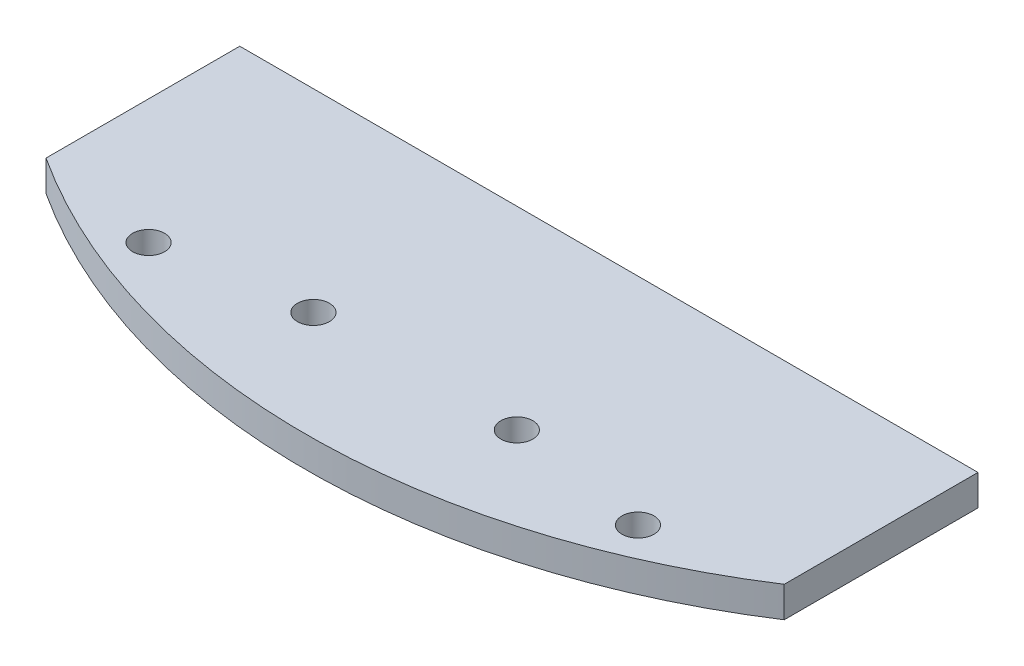
ISO-10303-21;
HEADER;
FILE_DESCRIPTION(('STEP AP214'),'2;1');
FILE_NAME('part.step','',(''),(''),'','','');
FILE_SCHEMA(('AUTOMOTIVE_DESIGN { 1 0 10303 214 1 1 1 1 }'));
ENDSEC;
DATA;
#1=APPLICATION_CONTEXT('core data for automotive mechanical design processes');
#2=APPLICATION_PROTOCOL_DEFINITION('international standard','automotive_design',2000,#1);
#3=PRODUCT_CONTEXT('',#1,'mechanical');
#4=PRODUCT('Part','Part','',(#3));
#5=PRODUCT_RELATED_PRODUCT_CATEGORY('part','',(#4));
#6=PRODUCT_DEFINITION_FORMATION('','',#4);
#7=PRODUCT_DEFINITION_CONTEXT('part definition',#1,'design');
#8=PRODUCT_DEFINITION('design','',#6,#7);
#9=PRODUCT_DEFINITION_SHAPE('','',#8);
#10=(LENGTH_UNIT() NAMED_UNIT(*) SI_UNIT(.MILLI.,.METRE.));
#11=(NAMED_UNIT(*) PLANE_ANGLE_UNIT() SI_UNIT($,.RADIAN.));
#12=(NAMED_UNIT(*) SI_UNIT($,.STERADIAN.) SOLID_ANGLE_UNIT());
#13=UNCERTAINTY_MEASURE_WITH_UNIT(LENGTH_MEASURE(1.E-05),#10,'distance_accuracy_value','');
#14=(GEOMETRIC_REPRESENTATION_CONTEXT(3) GLOBAL_UNCERTAINTY_ASSIGNED_CONTEXT((#13)) GLOBAL_UNIT_ASSIGNED_CONTEXT((#10,
#11,#12)) REPRESENTATION_CONTEXT('',''));
#15=CARTESIAN_POINT('',(0.,0.,0.));
#16=DIRECTION('',(0.,0.,1.));
#17=DIRECTION('',(1.,0.,0.));
#18=AXIS2_PLACEMENT_3D('',#15,#16,#17);
#19=CARTESIAN_POINT('',(0.,3.175,0.));
#20=DIRECTION('',(0.,-1.,0.));
#21=DIRECTION('',(0.,0.,-1.));
#22=AXIS2_PLACEMENT_3D('',#19,#20,#21);
#23=CYLINDRICAL_SURFACE('',#22,70.);
#24=CARTESIAN_POINT('',(0.,0.,0.));
#25=DIRECTION('',(0.,1.,0.));
#26=DIRECTION('',(0.,0.,1.));
#27=AXIS2_PLACEMENT_3D('',#24,#25,#26);
#28=CIRCLE('',#27,70.);
#29=CARTESIAN_POINT('',(38.1,0.,58.7229937928917));
#30=VERTEX_POINT('',#29);
#31=CARTESIAN_POINT('',(-38.1,0.,58.7229937928917));
#32=VERTEX_POINT('',#31);
#33=EDGE_CURVE('E111',#30,#32,#28,.F.);
#34=ORIENTED_EDGE('',*,*,#33,.F.);
#35=DIRECTION('',(0.,-1.,0.));
#36=VECTOR('',#35,1.);
#37=CARTESIAN_POINT('',(38.1,3.175,58.7229937928917));
#38=LINE('',#37,#36);
#39=CARTESIAN_POINT('',(38.1,3.175,58.7229937928917));
#40=VERTEX_POINT('',#39);
#41=EDGE_CURVE('E11',#40,#30,#38,.T.);
#42=ORIENTED_EDGE('',*,*,#41,.F.);
#43=CARTESIAN_POINT('',(0.,3.175,0.));
#44=DIRECTION('',(0.,1.,0.));
#45=DIRECTION('',(0.,0.,1.));
#46=AXIS2_PLACEMENT_3D('',#43,#44,#45);
#47=CIRCLE('',#46,70.);
#48=CARTESIAN_POINT('',(-38.1,3.175,58.7229937928917));
#49=VERTEX_POINT('',#48);
#50=EDGE_CURVE('E92',#40,#49,#47,.F.);
#51=ORIENTED_EDGE('',*,*,#50,.T.);
#52=DIRECTION('',(0.,-1.,0.));
#53=VECTOR('',#52,1.);
#54=CARTESIAN_POINT('',(-38.1,3.175,58.7229937928917));
#55=LINE('',#54,#53);
#56=EDGE_CURVE('E74',#49,#32,#55,.T.);
#57=ORIENTED_EDGE('',*,*,#56,.T.);
#58=EDGE_LOOP('',(#34,#42,#51,#57));
#59=FACE_BOUND('',#58,.T.);
#60=ADVANCED_FACE('F35',(#59),#23,.T.);
#61=CARTESIAN_POINT('',(38.1,3.175,0.));
#62=DIRECTION('',(1.,0.,0.));
#63=DIRECTION('',(0.,0.,-1.));
#64=AXIS2_PLACEMENT_3D('',#61,#62,#63);
#65=PLANE('',#64);
#66=DIRECTION('',(0.,0.,1.));
#67=VECTOR('',#66,1.);
#68=CARTESIAN_POINT('',(38.1,0.,0.));
#69=LINE('',#68,#67);
#70=CARTESIAN_POINT('',(38.1,0.,38.7229937928917));
#71=VERTEX_POINT('',#70);
#72=EDGE_CURVE('E85',#71,#30,#69,.T.);
#73=ORIENTED_EDGE('',*,*,#72,.F.);
#74=DIRECTION('',(0.,-1.,0.));
#75=VECTOR('',#74,1.);
#76=CARTESIAN_POINT('',(38.1,3.175,38.7229937928917));
#77=LINE('',#76,#75);
#78=CARTESIAN_POINT('',(38.1,3.175,38.7229937928917));
#79=VERTEX_POINT('',#78);
#80=EDGE_CURVE('E44',#79,#71,#77,.T.);
#81=ORIENTED_EDGE('',*,*,#80,.F.);
#82=DIRECTION('',(0.,0.,1.));
#83=VECTOR('',#82,1.);
#84=CARTESIAN_POINT('',(38.1,3.175,0.));
#85=LINE('',#84,#83);
#86=EDGE_CURVE('E83',#79,#40,#85,.T.);
#87=ORIENTED_EDGE('',*,*,#86,.T.);
#88=ORIENTED_EDGE('',*,*,#41,.T.);
#89=EDGE_LOOP('',(#73,#81,#87,#88));
#90=FACE_BOUND('',#89,.T.);
#91=ADVANCED_FACE('F82',(#90),#65,.T.);
#92=CARTESIAN_POINT('',(0.,3.175,38.7229937928917));
#93=DIRECTION('',(0.,0.,-1.));
#94=DIRECTION('',(-1.,0.,0.));
#95=AXIS2_PLACEMENT_3D('',#92,#93,#94);
#96=PLANE('',#95);
#97=DIRECTION('',(1.,0.,0.));
#98=VECTOR('',#97,1.);
#99=CARTESIAN_POINT('',(0.,0.,38.7229937928917));
#100=LINE('',#99,#98);
#101=CARTESIAN_POINT('',(-38.1,0.,38.7229937928917));
#102=VERTEX_POINT('',#101);
#103=EDGE_CURVE('E115',#102,#71,#100,.T.);
#104=ORIENTED_EDGE('',*,*,#103,.F.);
#105=DIRECTION('',(0.,-1.,0.));
#106=VECTOR('',#105,1.);
#107=CARTESIAN_POINT('',(-38.1,3.175,38.7229937928917));
#108=LINE('',#107,#106);
#109=CARTESIAN_POINT('',(-38.1,3.175,38.7229937928917));
#110=VERTEX_POINT('',#109);
#111=EDGE_CURVE('E67',#110,#102,#108,.T.);
#112=ORIENTED_EDGE('',*,*,#111,.F.);
#113=DIRECTION('',(1.,0.,0.));
#114=VECTOR('',#113,1.);
#115=CARTESIAN_POINT('',(0.,3.175,38.7229937928917));
#116=LINE('',#115,#114);
#117=EDGE_CURVE('E91',#110,#79,#116,.T.);
#118=ORIENTED_EDGE('',*,*,#117,.T.);
#119=ORIENTED_EDGE('',*,*,#80,.T.);
#120=EDGE_LOOP('',(#104,#112,#118,#119));
#121=FACE_BOUND('',#120,.T.);
#122=ADVANCED_FACE('F94',(#121),#96,.T.);
#123=CARTESIAN_POINT('',(-25.2571065360959,3.175,60.976049145745));
#124=DIRECTION('',(0.,-1.,0.));
#125=DIRECTION('',(0.,0.,-1.));
#126=AXIS2_PLACEMENT_3D('',#123,#124,#125);
#127=CYLINDRICAL_SURFACE('',#126,1.65);
#128=CARTESIAN_POINT('',(-25.2571065360959,3.175,60.976049145745));
#129=DIRECTION('',(0.,1.,0.));
#130=DIRECTION('',(0.,0.,1.));
#131=AXIS2_PLACEMENT_3D('',#128,#129,#130);
#132=CIRCLE('',#131,1.65);
#133=CARTESIAN_POINT('',(-25.2571065360959,3.175,62.626049145745));
#134=VERTEX_POINT('',#133);
#135=EDGE_CURVE('E132',#134,#134,#132,.T.);
#136=ORIENTED_EDGE('',*,*,#135,.T.);
#137=EDGE_LOOP('',(#136));
#138=FACE_BOUND('',#137,.T.);
#139=CARTESIAN_POINT('',(-25.2571065360959,0.,60.976049145745));
#140=DIRECTION('',(0.,1.,0.));
#141=DIRECTION('',(0.,0.,1.));
#142=AXIS2_PLACEMENT_3D('',#139,#140,#141);
#143=CIRCLE('',#142,1.65);
#144=CARTESIAN_POINT('',(-25.2571065360959,0.,62.626049145745));
#145=VERTEX_POINT('',#144);
#146=EDGE_CURVE('E108',#145,#145,#143,.T.);
#147=ORIENTED_EDGE('',*,*,#146,.F.);
#148=EDGE_LOOP('',(#147));
#149=FACE_BOUND('',#148,.T.);
#150=ADVANCED_FACE('F142',(#138,#149),#127,.F.);
#151=CARTESIAN_POINT('',(25.2571065360959,3.175,60.976049145745));
#152=DIRECTION('',(0.,-1.,0.));
#153=DIRECTION('',(0.,0.,-1.));
#154=AXIS2_PLACEMENT_3D('',#151,#152,#153);
#155=CYLINDRICAL_SURFACE('',#154,1.65);
#156=CARTESIAN_POINT('',(25.2571065360959,3.175,60.976049145745));
#157=DIRECTION('',(0.,1.,0.));
#158=DIRECTION('',(0.,0.,1.));
#159=AXIS2_PLACEMENT_3D('',#156,#157,#158);
#160=CIRCLE('',#159,1.65);
#161=CARTESIAN_POINT('',(25.2571065360959,3.175,62.626049145745));
#162=VERTEX_POINT('',#161);
#163=EDGE_CURVE('E127',#162,#162,#160,.T.);
#164=ORIENTED_EDGE('',*,*,#163,.T.);
#165=EDGE_LOOP('',(#164));
#166=FACE_BOUND('',#165,.T.);
#167=CARTESIAN_POINT('',(25.2571065360959,0.,60.976049145745));
#168=DIRECTION('',(0.,1.,0.));
#169=DIRECTION('',(0.,0.,1.));
#170=AXIS2_PLACEMENT_3D('',#167,#168,#169);
#171=CIRCLE('',#170,1.65);
#172=CARTESIAN_POINT('',(25.2571065360959,0.,62.626049145745));
#173=VERTEX_POINT('',#172);
#174=EDGE_CURVE('E105',#173,#173,#171,.T.);
#175=ORIENTED_EDGE('',*,*,#174,.F.);
#176=EDGE_LOOP('',(#175));
#177=FACE_BOUND('',#176,.T.);
#178=ADVANCED_FACE('F145',(#166,#177),#155,.F.);
#179=CARTESIAN_POINT('',(10.5,3.175,58.7229937928917));
#180=DIRECTION('',(0.,-1.,0.));
#181=DIRECTION('',(0.,0.,-1.));
#182=AXIS2_PLACEMENT_3D('',#179,#180,#181);
#183=CYLINDRICAL_SURFACE('',#182,1.65);
#184=CARTESIAN_POINT('',(10.5,3.175,58.7229937928917));
#185=DIRECTION('',(0.,1.,0.));
#186=DIRECTION('',(0.,0.,1.));
#187=AXIS2_PLACEMENT_3D('',#184,#185,#186);
#188=CIRCLE('',#187,1.65);
#189=CARTESIAN_POINT('',(10.5,3.175,60.3729937928917));
#190=VERTEX_POINT('',#189);
#191=EDGE_CURVE('E122',#190,#190,#188,.T.);
#192=ORIENTED_EDGE('',*,*,#191,.T.);
#193=EDGE_LOOP('',(#192));
#194=FACE_BOUND('',#193,.T.);
#195=CARTESIAN_POINT('',(10.5,0.,58.7229937928917));
#196=DIRECTION('',(0.,1.,0.));
#197=DIRECTION('',(0.,0.,1.));
#198=AXIS2_PLACEMENT_3D('',#195,#196,#197);
#199=CIRCLE('',#198,1.65);
#200=CARTESIAN_POINT('',(10.5,0.,60.3729937928917));
#201=VERTEX_POINT('',#200);
#202=EDGE_CURVE('E102',#201,#201,#199,.T.);
#203=ORIENTED_EDGE('',*,*,#202,.F.);
#204=EDGE_LOOP('',(#203));
#205=FACE_BOUND('',#204,.T.);
#206=ADVANCED_FACE('F148',(#194,#205),#183,.F.);
#207=CARTESIAN_POINT('',(-10.5,3.175,58.7229937928918));
#208=DIRECTION('',(0.,-1.,0.));
#209=DIRECTION('',(0.,0.,-1.));
#210=AXIS2_PLACEMENT_3D('',#207,#208,#209);
#211=CYLINDRICAL_SURFACE('',#210,1.65);
#212=CARTESIAN_POINT('',(-10.5,3.175,58.7229937928918));
#213=DIRECTION('',(0.,1.,0.));
#214=DIRECTION('',(0.,0.,1.));
#215=AXIS2_PLACEMENT_3D('',#212,#213,#214);
#216=CIRCLE('',#215,1.65);
#217=CARTESIAN_POINT('',(-10.5,3.175,60.3729937928918));
#218=VERTEX_POINT('',#217);
#219=EDGE_CURVE('E119',#218,#218,#216,.T.);
#220=ORIENTED_EDGE('',*,*,#219,.T.);
#221=EDGE_LOOP('',(#220));
#222=FACE_BOUND('',#221,.T.);
#223=CARTESIAN_POINT('',(-10.5,0.,58.7229937928918));
#224=DIRECTION('',(0.,1.,0.));
#225=DIRECTION('',(0.,0.,1.));
#226=AXIS2_PLACEMENT_3D('',#223,#224,#225);
#227=CIRCLE('',#226,1.65);
#228=CARTESIAN_POINT('',(-10.5,0.,60.3729937928918));
#229=VERTEX_POINT('',#228);
#230=EDGE_CURVE('E99',#229,#229,#227,.T.);
#231=ORIENTED_EDGE('',*,*,#230,.F.);
#232=EDGE_LOOP('',(#231));
#233=FACE_BOUND('',#232,.T.);
#234=ADVANCED_FACE('F37',(#222,#233),#211,.F.);
#235=CARTESIAN_POINT('',(-38.1,3.175,0.));
#236=DIRECTION('',(1.,0.,0.));
#237=DIRECTION('',(0.,0.,-1.));
#238=AXIS2_PLACEMENT_3D('',#235,#236,#237);
#239=PLANE('',#238);
#240=DIRECTION('',(0.,0.,1.));
#241=VECTOR('',#240,1.);
#242=CARTESIAN_POINT('',(-38.1,0.,0.));
#243=LINE('',#242,#241);
#244=EDGE_CURVE('E117',#102,#32,#243,.T.);
#245=ORIENTED_EDGE('',*,*,#244,.T.);
#246=ORIENTED_EDGE('',*,*,#56,.F.);
#247=DIRECTION('',(0.,0.,1.));
#248=VECTOR('',#247,1.);
#249=CARTESIAN_POINT('',(-38.1,3.175,0.));
#250=LINE('',#249,#248);
#251=EDGE_CURVE('E52',#110,#49,#250,.T.);
#252=ORIENTED_EDGE('',*,*,#251,.F.);
#253=ORIENTED_EDGE('',*,*,#111,.T.);
#254=EDGE_LOOP('',(#245,#246,#252,#253));
#255=FACE_BOUND('',#254,.T.);
#256=ADVANCED_FACE('F155',(#255),#239,.F.);
#257=CARTESIAN_POINT('',(0.,3.175,0.));
#258=DIRECTION('',(0.,1.,0.));
#259=DIRECTION('',(0.,0.,1.));
#260=AXIS2_PLACEMENT_3D('',#257,#258,#259);
#261=PLANE('',#260);
#262=ORIENTED_EDGE('',*,*,#219,.F.);
#263=EDGE_LOOP('',(#262));
#264=FACE_BOUND('',#263,.T.);
#265=ORIENTED_EDGE('',*,*,#191,.F.);
#266=EDGE_LOOP('',(#265));
#267=FACE_BOUND('',#266,.T.);
#268=ORIENTED_EDGE('',*,*,#163,.F.);
#269=EDGE_LOOP('',(#268));
#270=FACE_BOUND('',#269,.T.);
#271=ORIENTED_EDGE('',*,*,#135,.F.);
#272=EDGE_LOOP('',(#271));
#273=FACE_BOUND('',#272,.T.);
#274=ORIENTED_EDGE('',*,*,#50,.F.);
#275=ORIENTED_EDGE('',*,*,#86,.F.);
#276=ORIENTED_EDGE('',*,*,#117,.F.);
#277=ORIENTED_EDGE('',*,*,#251,.T.);
#278=EDGE_LOOP('',(#274,#275,#276,#277));
#279=FACE_BOUND('',#278,.T.);
#280=ADVANCED_FACE('F90',(#264,#267,#270,#273,#279),#261,.T.);
#281=CARTESIAN_POINT('',(0.,0.,0.));
#282=DIRECTION('',(0.,1.,0.));
#283=DIRECTION('',(0.,0.,1.));
#284=AXIS2_PLACEMENT_3D('',#281,#282,#283);
#285=PLANE('',#284);
#286=ORIENTED_EDGE('',*,*,#230,.T.);
#287=EDGE_LOOP('',(#286));
#288=FACE_BOUND('',#287,.T.);
#289=ORIENTED_EDGE('',*,*,#202,.T.);
#290=EDGE_LOOP('',(#289));
#291=FACE_BOUND('',#290,.T.);
#292=ORIENTED_EDGE('',*,*,#174,.T.);
#293=EDGE_LOOP('',(#292));
#294=FACE_BOUND('',#293,.T.);
#295=ORIENTED_EDGE('',*,*,#146,.T.);
#296=EDGE_LOOP('',(#295));
#297=FACE_BOUND('',#296,.T.);
#298=ORIENTED_EDGE('',*,*,#33,.T.);
#299=ORIENTED_EDGE('',*,*,#244,.F.);
#300=ORIENTED_EDGE('',*,*,#103,.T.);
#301=ORIENTED_EDGE('',*,*,#72,.T.);
#302=EDGE_LOOP('',(#298,#299,#300,#301));
#303=FACE_BOUND('',#302,.T.);
#304=ADVANCED_FACE('F160',(#288,#291,#294,#297,#303),#285,.F.);
#305=CLOSED_SHELL('',(#60,#91,#122,#150,#178,#206,#234,#256,#280,#304));
#306=MANIFOLD_SOLID_BREP('B2',#305);
#307=ADVANCED_BREP_SHAPE_REPRESENTATION('',(#18,#306),#14);
#308=SHAPE_DEFINITION_REPRESENTATION(#9,#307);
ENDSEC;
END-ISO-10303-21;
